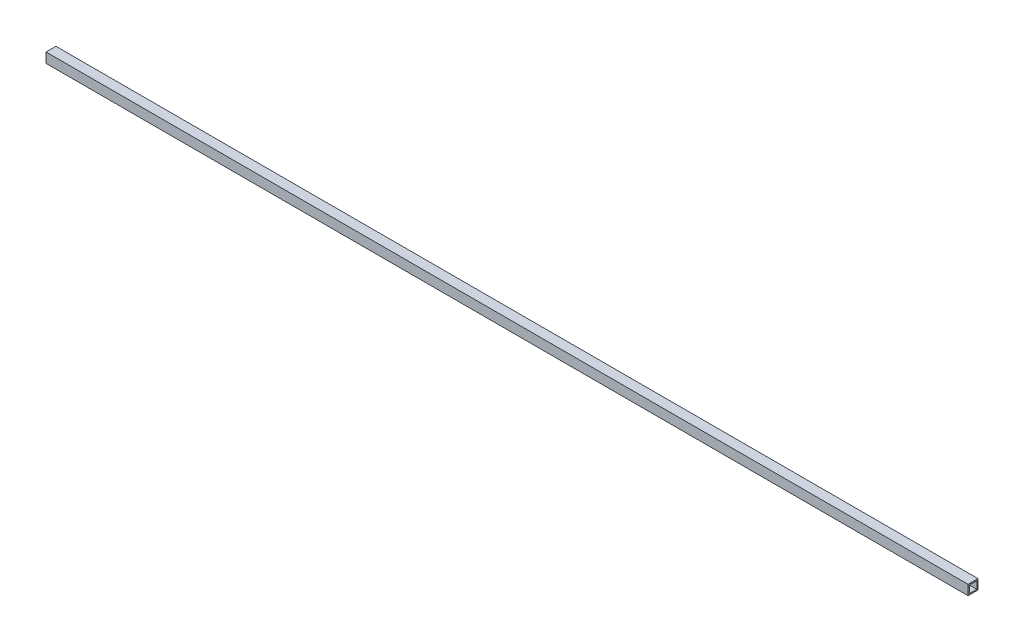
ISO-10303-21;
HEADER;
FILE_DESCRIPTION(('STEP AP214'),'2;1');
FILE_NAME('part.step','',(''),(''),'','','');
FILE_SCHEMA(('AUTOMOTIVE_DESIGN { 1 0 10303 214 1 1 1 1 }'));
ENDSEC;
DATA;
#1=APPLICATION_CONTEXT('core data for automotive mechanical design processes');
#2=APPLICATION_PROTOCOL_DEFINITION('international standard','automotive_design',2000,#1);
#3=PRODUCT_CONTEXT('',#1,'mechanical');
#4=PRODUCT('Part','Part','',(#3));
#5=PRODUCT_RELATED_PRODUCT_CATEGORY('part','',(#4));
#6=PRODUCT_DEFINITION_FORMATION('','',#4);
#7=PRODUCT_DEFINITION_CONTEXT('part definition',#1,'design');
#8=PRODUCT_DEFINITION('design','',#6,#7);
#9=PRODUCT_DEFINITION_SHAPE('','',#8);
#10=(LENGTH_UNIT() NAMED_UNIT(*) SI_UNIT(.MILLI.,.METRE.));
#11=(NAMED_UNIT(*) PLANE_ANGLE_UNIT() SI_UNIT($,.RADIAN.));
#12=(NAMED_UNIT(*) SI_UNIT($,.STERADIAN.) SOLID_ANGLE_UNIT());
#13=UNCERTAINTY_MEASURE_WITH_UNIT(LENGTH_MEASURE(1.E-05),#10,'distance_accuracy_value','');
#14=(GEOMETRIC_REPRESENTATION_CONTEXT(3) GLOBAL_UNCERTAINTY_ASSIGNED_CONTEXT((#13)) GLOBAL_UNIT_ASSIGNED_CONTEXT((#10,
#11,#12)) REPRESENTATION_CONTEXT('',''));
#15=CARTESIAN_POINT('',(0.,0.,0.));
#16=DIRECTION('',(0.,0.,1.));
#17=DIRECTION('',(1.,0.,0.));
#18=AXIS2_PLACEMENT_3D('',#15,#16,#17);
#19=CARTESIAN_POINT('',(4808.30704896854,25.4,-25.4));
#20=DIRECTION('',(0.,-1.,0.));
#21=DIRECTION('',(0.,0.,-1.));
#22=AXIS2_PLACEMENT_3D('',#19,#20,#21);
#23=PLANE('',#22);
#24=DIRECTION('',(0.,0.,1.));
#25=VECTOR('',#24,1.);
#26=CARTESIAN_POINT('',(4736.46499999999,25.4,-25.4));
#27=LINE('',#26,#25);
#28=CARTESIAN_POINT('',(4736.46499999999,25.4,-25.4));
#29=VERTEX_POINT('',#28);
#30=CARTESIAN_POINT('',(4736.46499999999,25.4,25.4));
#31=VERTEX_POINT('',#30);
#32=EDGE_CURVE('E177',#29,#31,#27,.T.);
#33=ORIENTED_EDGE('',*,*,#32,.F.);
#34=DIRECTION('',(-1.,0.,0.));
#35=VECTOR('',#34,1.);
#36=CARTESIAN_POINT('',(4808.30704896854,25.4,-25.4));
#37=LINE('',#36,#35);
#38=CARTESIAN_POINT('',(0.,25.4,-25.4));
#39=VERTEX_POINT('',#38);
#40=EDGE_CURVE('E53',#29,#39,#37,.T.);
#41=ORIENTED_EDGE('',*,*,#40,.T.);
#42=DIRECTION('',(0.,0.,1.));
#43=VECTOR('',#42,1.);
#44=CARTESIAN_POINT('',(0.,25.4,-25.4));
#45=LINE('',#44,#43);
#46=CARTESIAN_POINT('',(0.,25.4,25.4));
#47=VERTEX_POINT('',#46);
#48=EDGE_CURVE('E145',#39,#47,#45,.T.);
#49=ORIENTED_EDGE('',*,*,#48,.T.);
#50=DIRECTION('',(-1.,0.,0.));
#51=VECTOR('',#50,1.);
#52=CARTESIAN_POINT('',(4808.30704896854,25.4,25.4));
#53=LINE('',#52,#51);
#54=EDGE_CURVE('E149',#31,#47,#53,.T.);
#55=ORIENTED_EDGE('',*,*,#54,.F.);
#56=EDGE_LOOP('',(#33,#41,#49,#55));
#57=FACE_BOUND('',#56,.T.);
#58=ADVANCED_FACE('F37',(#57),#23,.F.);
#59=CARTESIAN_POINT('',(4808.30704896854,25.4,-25.4));
#60=DIRECTION('',(0.,0.,1.));
#61=DIRECTION('',(0.,-1.,0.));
#62=AXIS2_PLACEMENT_3D('',#59,#60,#61);
#63=PLANE('',#62);
#64=DIRECTION('',(0.,1.,0.));
#65=VECTOR('',#64,1.);
#66=CARTESIAN_POINT('',(4736.46499999999,25.4,-25.4));
#67=LINE('',#66,#65);
#68=CARTESIAN_POINT('',(4736.46499999999,-25.4,-25.4));
#69=VERTEX_POINT('',#68);
#70=EDGE_CURVE('E180',#69,#29,#67,.T.);
#71=ORIENTED_EDGE('',*,*,#70,.F.);
#72=DIRECTION('',(-1.,0.,0.));
#73=VECTOR('',#72,1.);
#74=CARTESIAN_POINT('',(4808.30704896854,-25.4,-25.4));
#75=LINE('',#74,#73);
#76=CARTESIAN_POINT('',(0.,-25.4,-25.4));
#77=VERTEX_POINT('',#76);
#78=EDGE_CURVE('E154',#69,#77,#75,.T.);
#79=ORIENTED_EDGE('',*,*,#78,.T.);
#80=DIRECTION('',(0.,1.,0.));
#81=VECTOR('',#80,1.);
#82=CARTESIAN_POINT('',(0.,25.4,-25.4));
#83=LINE('',#82,#81);
#84=EDGE_CURVE('E142',#77,#39,#83,.T.);
#85=ORIENTED_EDGE('',*,*,#84,.T.);
#86=ORIENTED_EDGE('',*,*,#40,.F.);
#87=EDGE_LOOP('',(#71,#79,#85,#86));
#88=FACE_BOUND('',#87,.T.);
#89=ADVANCED_FACE('F179',(#88),#63,.F.);
#90=CARTESIAN_POINT('',(4808.30704896854,-25.4,-25.4));
#91=DIRECTION('',(0.,1.,0.));
#92=DIRECTION('',(0.,0.,1.));
#93=AXIS2_PLACEMENT_3D('',#90,#91,#92);
#94=PLANE('',#93);
#95=DIRECTION('',(0.,0.,-1.));
#96=VECTOR('',#95,1.);
#97=CARTESIAN_POINT('',(4736.46499999999,-25.4,-25.4));
#98=LINE('',#97,#96);
#99=CARTESIAN_POINT('',(4736.46499999999,-25.4,25.4));
#100=VERTEX_POINT('',#99);
#101=EDGE_CURVE('E165',#100,#69,#98,.T.);
#102=ORIENTED_EDGE('',*,*,#101,.F.);
#103=DIRECTION('',(-1.,0.,0.));
#104=VECTOR('',#103,1.);
#105=CARTESIAN_POINT('',(4808.30704896854,-25.4,25.4));
#106=LINE('',#105,#104);
#107=CARTESIAN_POINT('',(0.,-25.4,25.4));
#108=VERTEX_POINT('',#107);
#109=EDGE_CURVE('E46',#100,#108,#106,.T.);
#110=ORIENTED_EDGE('',*,*,#109,.T.);
#111=DIRECTION('',(0.,0.,-1.));
#112=VECTOR('',#111,1.);
#113=CARTESIAN_POINT('',(0.,-25.4,-25.4));
#114=LINE('',#113,#112);
#115=EDGE_CURVE('E138',#108,#77,#114,.T.);
#116=ORIENTED_EDGE('',*,*,#115,.T.);
#117=ORIENTED_EDGE('',*,*,#78,.F.);
#118=EDGE_LOOP('',(#102,#110,#116,#117));
#119=FACE_BOUND('',#118,.T.);
#120=ADVANCED_FACE('F161',(#119),#94,.F.);
#121=CARTESIAN_POINT('',(4808.30704896854,25.4,25.4));
#122=DIRECTION('',(0.,0.,-1.));
#123=DIRECTION('',(-1.,0.,0.));
#124=AXIS2_PLACEMENT_3D('',#121,#122,#123);
#125=PLANE('',#124);
#126=DIRECTION('',(0.,-1.,0.));
#127=VECTOR('',#126,1.);
#128=CARTESIAN_POINT('',(4736.46499999999,25.4,25.4));
#129=LINE('',#128,#127);
#130=EDGE_CURVE('E174',#31,#100,#129,.T.);
#131=ORIENTED_EDGE('',*,*,#130,.F.);
#132=ORIENTED_EDGE('',*,*,#54,.T.);
#133=DIRECTION('',(0.,-1.,0.));
#134=VECTOR('',#133,1.);
#135=CARTESIAN_POINT('',(0.,25.4,25.4));
#136=LINE('',#135,#134);
#137=EDGE_CURVE('E134',#47,#108,#136,.T.);
#138=ORIENTED_EDGE('',*,*,#137,.T.);
#139=ORIENTED_EDGE('',*,*,#109,.F.);
#140=EDGE_LOOP('',(#131,#132,#138,#139));
#141=FACE_BOUND('',#140,.T.);
#142=ADVANCED_FACE('F39',(#141),#125,.F.);
#143=CARTESIAN_POINT('',(0.,0.,0.));
#144=DIRECTION('',(-1.,0.,0.));
#145=DIRECTION('',(0.,0.,1.));
#146=AXIS2_PLACEMENT_3D('',#143,#144,#145);
#147=PLANE('',#146);
#148=ORIENTED_EDGE('',*,*,#137,.F.);
#149=ORIENTED_EDGE('',*,*,#48,.F.);
#150=ORIENTED_EDGE('',*,*,#84,.F.);
#151=ORIENTED_EDGE('',*,*,#115,.F.);
#152=EDGE_LOOP('',(#148,#149,#150,#151));
#153=FACE_BOUND('',#152,.T.);
#154=DIRECTION('',(0.,1.,0.));
#155=VECTOR('',#154,1.);
#156=CARTESIAN_POINT('',(0.,19.05,-19.05));
#157=LINE('',#156,#155);
#158=CARTESIAN_POINT('',(0.,-19.05,-19.05));
#159=VERTEX_POINT('',#158);
#160=CARTESIAN_POINT('',(0.,19.05,-19.05));
#161=VERTEX_POINT('',#160);
#162=EDGE_CURVE('E119',#159,#161,#157,.T.);
#163=ORIENTED_EDGE('',*,*,#162,.T.);
#164=DIRECTION('',(0.,0.,1.));
#165=VECTOR('',#164,1.);
#166=CARTESIAN_POINT('',(0.,19.05,-19.05));
#167=LINE('',#166,#165);
#168=CARTESIAN_POINT('',(0.,19.05,19.05));
#169=VERTEX_POINT('',#168);
#170=EDGE_CURVE('E186',#161,#169,#167,.T.);
#171=ORIENTED_EDGE('',*,*,#170,.T.);
#172=DIRECTION('',(0.,-1.,0.));
#173=VECTOR('',#172,1.);
#174=CARTESIAN_POINT('',(0.,19.05,19.05));
#175=LINE('',#174,#173);
#176=CARTESIAN_POINT('',(0.,-19.05,19.05));
#177=VERTEX_POINT('',#176);
#178=EDGE_CURVE('E194',#169,#177,#175,.T.);
#179=ORIENTED_EDGE('',*,*,#178,.T.);
#180=DIRECTION('',(0.,0.,-1.));
#181=VECTOR('',#180,1.);
#182=CARTESIAN_POINT('',(0.,-19.05,-19.05));
#183=LINE('',#182,#181);
#184=EDGE_CURVE('E198',#177,#159,#183,.T.);
#185=ORIENTED_EDGE('',*,*,#184,.T.);
#186=EDGE_LOOP('',(#163,#171,#179,#185));
#187=FACE_BOUND('',#186,.T.);
#188=ADVANCED_FACE('F171',(#153,#187),#147,.T.);
#189=CARTESIAN_POINT('',(4808.30704896854,19.05,-19.05));
#190=DIRECTION('',(0.,0.,1.));
#191=DIRECTION('',(0.,-1.,0.));
#192=AXIS2_PLACEMENT_3D('',#189,#190,#191);
#193=PLANE('',#192);
#194=DIRECTION('',(-1.,0.,0.));
#195=VECTOR('',#194,1.);
#196=CARTESIAN_POINT('',(4808.30704896854,-19.05,-19.05));
#197=LINE('',#196,#195);
#198=CARTESIAN_POINT('',(4736.46499999999,-19.05,-19.05));
#199=VERTEX_POINT('',#198);
#200=EDGE_CURVE('E110',#199,#159,#197,.T.);
#201=ORIENTED_EDGE('',*,*,#200,.F.);
#202=DIRECTION('',(0.,1.,0.));
#203=VECTOR('',#202,1.);
#204=CARTESIAN_POINT('',(4736.46499999999,19.05,-19.05));
#205=LINE('',#204,#203);
#206=CARTESIAN_POINT('',(4736.46499999999,19.05,-19.05));
#207=VERTEX_POINT('',#206);
#208=EDGE_CURVE('E11',#199,#207,#205,.T.);
#209=ORIENTED_EDGE('',*,*,#208,.T.);
#210=DIRECTION('',(-1.,0.,0.));
#211=VECTOR('',#210,1.);
#212=CARTESIAN_POINT('',(4808.30704896854,19.05,-19.05));
#213=LINE('',#212,#211);
#214=EDGE_CURVE('E122',#207,#161,#213,.T.);
#215=ORIENTED_EDGE('',*,*,#214,.T.);
#216=ORIENTED_EDGE('',*,*,#162,.F.);
#217=EDGE_LOOP('',(#201,#209,#215,#216));
#218=FACE_BOUND('',#217,.T.);
#219=ADVANCED_FACE('F117',(#218),#193,.T.);
#220=CARTESIAN_POINT('',(4808.30704896854,-19.05,-19.05));
#221=DIRECTION('',(0.,1.,0.));
#222=DIRECTION('',(0.,0.,1.));
#223=AXIS2_PLACEMENT_3D('',#220,#221,#222);
#224=PLANE('',#223);
#225=DIRECTION('',(-1.,0.,0.));
#226=VECTOR('',#225,1.);
#227=CARTESIAN_POINT('',(4808.30704896854,-19.05,19.05));
#228=LINE('',#227,#226);
#229=CARTESIAN_POINT('',(4736.46499999999,-19.05,19.05));
#230=VERTEX_POINT('',#229);
#231=EDGE_CURVE('E112',#230,#177,#228,.T.);
#232=ORIENTED_EDGE('',*,*,#231,.F.);
#233=DIRECTION('',(0.,0.,-1.));
#234=VECTOR('',#233,1.);
#235=CARTESIAN_POINT('',(4736.46499999999,-19.05,-19.05));
#236=LINE('',#235,#234);
#237=EDGE_CURVE('E103',#230,#199,#236,.T.);
#238=ORIENTED_EDGE('',*,*,#237,.T.);
#239=ORIENTED_EDGE('',*,*,#200,.T.);
#240=ORIENTED_EDGE('',*,*,#184,.F.);
#241=EDGE_LOOP('',(#232,#238,#239,#240));
#242=FACE_BOUND('',#241,.T.);
#243=ADVANCED_FACE('F108',(#242),#224,.T.);
#244=CARTESIAN_POINT('',(4808.30704896854,19.05,19.05));
#245=DIRECTION('',(0.,0.,-1.));
#246=DIRECTION('',(0.,1.,0.));
#247=AXIS2_PLACEMENT_3D('',#244,#245,#246);
#248=PLANE('',#247);
#249=DIRECTION('',(-1.,0.,0.));
#250=VECTOR('',#249,1.);
#251=CARTESIAN_POINT('',(4808.30704896854,19.05,19.05));
#252=LINE('',#251,#250);
#253=CARTESIAN_POINT('',(4736.46499999999,19.05,19.05));
#254=VERTEX_POINT('',#253);
#255=EDGE_CURVE('E127',#254,#169,#252,.T.);
#256=ORIENTED_EDGE('',*,*,#255,.F.);
#257=DIRECTION('',(0.,-1.,0.));
#258=VECTOR('',#257,1.);
#259=CARTESIAN_POINT('',(4736.46499999999,19.05,19.05));
#260=LINE('',#259,#258);
#261=EDGE_CURVE('E115',#254,#230,#260,.T.);
#262=ORIENTED_EDGE('',*,*,#261,.T.);
#263=ORIENTED_EDGE('',*,*,#231,.T.);
#264=ORIENTED_EDGE('',*,*,#178,.F.);
#265=EDGE_LOOP('',(#256,#262,#263,#264));
#266=FACE_BOUND('',#265,.T.);
#267=ADVANCED_FACE('F206',(#266),#248,.T.);
#268=CARTESIAN_POINT('',(4808.30704896854,19.05,-19.05));
#269=DIRECTION('',(0.,-1.,0.));
#270=DIRECTION('',(0.,0.,-1.));
#271=AXIS2_PLACEMENT_3D('',#268,#269,#270);
#272=PLANE('',#271);
#273=ORIENTED_EDGE('',*,*,#214,.F.);
#274=DIRECTION('',(0.,0.,1.));
#275=VECTOR('',#274,1.);
#276=CARTESIAN_POINT('',(4736.46499999999,19.05,-19.05));
#277=LINE('',#276,#275);
#278=EDGE_CURVE('E61',#207,#254,#277,.T.);
#279=ORIENTED_EDGE('',*,*,#278,.T.);
#280=ORIENTED_EDGE('',*,*,#255,.T.);
#281=ORIENTED_EDGE('',*,*,#170,.F.);
#282=EDGE_LOOP('',(#273,#279,#280,#281));
#283=FACE_BOUND('',#282,.T.);
#284=ADVANCED_FACE('F217',(#283),#272,.T.);
#285=CARTESIAN_POINT('',(4736.46499999999,-31.75,-652.045130055595));
#286=DIRECTION('',(1.,0.,0.));
#287=DIRECTION('',(0.,0.,-1.));
#288=AXIS2_PLACEMENT_3D('',#285,#286,#287);
#289=PLANE('',#288);
#290=ORIENTED_EDGE('',*,*,#278,.F.);
#291=ORIENTED_EDGE('',*,*,#208,.F.);
#292=ORIENTED_EDGE('',*,*,#237,.F.);
#293=ORIENTED_EDGE('',*,*,#261,.F.);
#294=EDGE_LOOP('',(#290,#291,#292,#293));
#295=FACE_BOUND('',#294,.T.);
#296=ORIENTED_EDGE('',*,*,#32,.T.);
#297=ORIENTED_EDGE('',*,*,#130,.T.);
#298=ORIENTED_EDGE('',*,*,#101,.T.);
#299=ORIENTED_EDGE('',*,*,#70,.T.);
#300=EDGE_LOOP('',(#296,#297,#298,#299));
#301=FACE_BOUND('',#300,.T.);
#302=ADVANCED_FACE('F101',(#295,#301),#289,.T.);
#303=CLOSED_SHELL('',(#58,#89,#120,#142,#188,#219,#243,#267,#284,#302));
#304=MANIFOLD_SOLID_BREP('B2',#303);
#305=ADVANCED_BREP_SHAPE_REPRESENTATION('',(#18,#304),#14);
#306=SHAPE_DEFINITION_REPRESENTATION(#9,#305);
ENDSEC;
END-ISO-10303-21;
